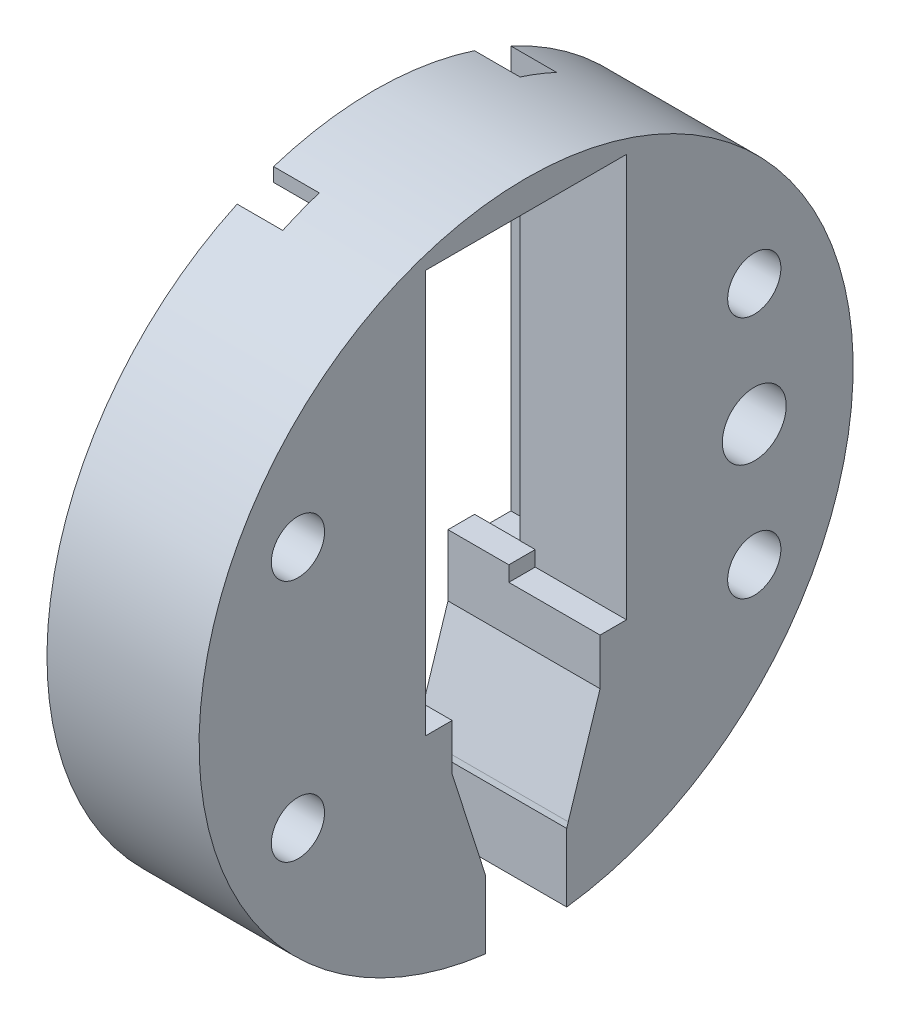
ISO-10303-21;
HEADER;
FILE_DESCRIPTION(('STEP AP214'),'2;1');
FILE_NAME('part.step','',(''),(''),'','','');
FILE_SCHEMA(('AUTOMOTIVE_DESIGN { 1 0 10303 214 1 1 1 1 }'));
ENDSEC;
DATA;
#1=APPLICATION_CONTEXT('core data for automotive mechanical design processes');
#2=APPLICATION_PROTOCOL_DEFINITION('international standard','automotive_design',2000,#1);
#3=PRODUCT_CONTEXT('',#1,'mechanical');
#4=PRODUCT('Part','Part','',(#3));
#5=PRODUCT_RELATED_PRODUCT_CATEGORY('part','',(#4));
#6=PRODUCT_DEFINITION_FORMATION('','',#4);
#7=PRODUCT_DEFINITION_CONTEXT('part definition',#1,'design');
#8=PRODUCT_DEFINITION('design','',#6,#7);
#9=PRODUCT_DEFINITION_SHAPE('','',#8);
#10=(LENGTH_UNIT() NAMED_UNIT(*) SI_UNIT(.MILLI.,.METRE.));
#11=(NAMED_UNIT(*) PLANE_ANGLE_UNIT() SI_UNIT($,.RADIAN.));
#12=(NAMED_UNIT(*) SI_UNIT($,.STERADIAN.) SOLID_ANGLE_UNIT());
#13=UNCERTAINTY_MEASURE_WITH_UNIT(LENGTH_MEASURE(1.E-05),#10,'distance_accuracy_value','');
#14=(GEOMETRIC_REPRESENTATION_CONTEXT(3) GLOBAL_UNCERTAINTY_ASSIGNED_CONTEXT((#13)) GLOBAL_UNIT_ASSIGNED_CONTEXT((#10,
#11,#12)) REPRESENTATION_CONTEXT('',''));
#15=CARTESIAN_POINT('',(0.,0.,0.));
#16=DIRECTION('',(0.,0.,1.));
#17=DIRECTION('',(1.,0.,0.));
#18=AXIS2_PLACEMENT_3D('',#15,#16,#17);
#19=CARTESIAN_POINT('',(56.710747831414,19.5568517413347,6.6));
#20=DIRECTION('',(0.,0.,-1.));
#21=DIRECTION('',(0.,1.,0.));
#22=AXIS2_PLACEMENT_3D('',#19,#20,#21);
#23=PLANE('',#22);
#24=DIRECTION('',(0.,1.,0.));
#25=VECTOR('',#24,1.);
#26=CARTESIAN_POINT('',(3.,19.5568517413347,6.6));
#27=LINE('',#26,#25);
#28=CARTESIAN_POINT('',(3.,-5.94314825866529,6.6));
#29=VERTEX_POINT('',#28);
#30=CARTESIAN_POINT('',(3.,19.5568517413347,6.6));
#31=VERTEX_POINT('',#30);
#32=EDGE_CURVE('E255',#29,#31,#27,.T.);
#33=ORIENTED_EDGE('',*,*,#32,.T.);
#34=DIRECTION('',(-1.,0.,0.));
#35=VECTOR('',#34,1.);
#36=CARTESIAN_POINT('',(56.710747831414,19.5568517413347,6.6));
#37=LINE('',#36,#35);
#38=CARTESIAN_POINT('',(10.,19.5568517413347,6.6));
#39=VERTEX_POINT('',#38);
#40=EDGE_CURVE('E304',#39,#31,#37,.T.);
#41=ORIENTED_EDGE('',*,*,#40,.F.);
#42=DIRECTION('',(0.,-1.,0.));
#43=VECTOR('',#42,1.);
#44=CARTESIAN_POINT('',(10.,19.5568517413347,6.6));
#45=LINE('',#44,#43);
#46=CARTESIAN_POINT('',(10.,-6.94314825866529,6.6));
#47=VERTEX_POINT('',#46);
#48=EDGE_CURVE('E328',#39,#47,#45,.T.);
#49=ORIENTED_EDGE('',*,*,#48,.T.);
#50=DIRECTION('',(-1.,0.,0.));
#51=VECTOR('',#50,1.);
#52=CARTESIAN_POINT('',(56.710747831414,-6.94314825866529,6.6));
#53=LINE('',#52,#51);
#54=CARTESIAN_POINT('',(6.5,-6.94314825866529,6.6));
#55=VERTEX_POINT('',#54);
#56=EDGE_CURVE('E299',#47,#55,#53,.T.);
#57=ORIENTED_EDGE('',*,*,#56,.T.);
#58=DIRECTION('',(0.,-1.,0.));
#59=VECTOR('',#58,1.);
#60=CARTESIAN_POINT('',(6.5,-5.94314825866529,6.6));
#61=LINE('',#60,#59);
#62=CARTESIAN_POINT('',(6.5,-5.94314825866529,6.6));
#63=VERTEX_POINT('',#62);
#64=EDGE_CURVE('E395',#63,#55,#61,.T.);
#65=ORIENTED_EDGE('',*,*,#64,.F.);
#66=DIRECTION('',(1.,0.,0.));
#67=VECTOR('',#66,1.);
#68=CARTESIAN_POINT('',(0.,-5.94314825866529,6.6));
#69=LINE('',#68,#67);
#70=EDGE_CURVE('E414',#29,#63,#69,.T.);
#71=ORIENTED_EDGE('',*,*,#70,.F.);
#72=EDGE_LOOP('',(#33,#41,#49,#57,#65,#71));
#73=FACE_BOUND('',#72,.T.);
#74=ADVANCED_FACE('F33',(#73),#23,.T.);
#75=CARTESIAN_POINT('',(56.710747831414,19.5568517413347,-6.6));
#76=DIRECTION('',(0.,0.,-1.));
#77=DIRECTION('',(0.,1.,0.));
#78=AXIS2_PLACEMENT_3D('',#75,#76,#77);
#79=PLANE('',#78);
#80=DIRECTION('',(-1.,0.,0.));
#81=VECTOR('',#80,1.);
#82=CARTESIAN_POINT('',(56.710747831414,19.5568517413347,-6.6));
#83=LINE('',#82,#81);
#84=CARTESIAN_POINT('',(10.,19.5568517413347,-6.6));
#85=VERTEX_POINT('',#84);
#86=CARTESIAN_POINT('',(3.,19.5568517413347,-6.6));
#87=VERTEX_POINT('',#86);
#88=EDGE_CURVE('E265',#85,#87,#83,.T.);
#89=ORIENTED_EDGE('',*,*,#88,.T.);
#90=DIRECTION('',(0.,1.,0.));
#91=VECTOR('',#90,1.);
#92=CARTESIAN_POINT('',(3.,19.5568517413347,-6.6));
#93=LINE('',#92,#91);
#94=CARTESIAN_POINT('',(3.,-5.9431482586653,-6.60000000000001));
#95=VERTEX_POINT('',#94);
#96=EDGE_CURVE('E330',#95,#87,#93,.T.);
#97=ORIENTED_EDGE('',*,*,#96,.F.);
#98=DIRECTION('',(-1.,0.,0.));
#99=VECTOR('',#98,1.);
#100=CARTESIAN_POINT('',(56.710747831414,-5.9431482586653,-6.60000000000001));
#101=LINE('',#100,#99);
#102=CARTESIAN_POINT('',(4.,-5.9431482586653,-6.60000000000001));
#103=VERTEX_POINT('',#102);
#104=EDGE_CURVE('E371',#103,#95,#101,.T.);
#105=ORIENTED_EDGE('',*,*,#104,.F.);
#106=DIRECTION('',(0.,1.,0.));
#107=VECTOR('',#106,1.);
#108=CARTESIAN_POINT('',(4.,19.5568517413347,-6.6));
#109=LINE('',#108,#107);
#110=CARTESIAN_POINT('',(4.,-6.9431482586653,-6.60000000000001));
#111=VERTEX_POINT('',#110);
#112=EDGE_CURVE('E234',#111,#103,#109,.T.);
#113=ORIENTED_EDGE('',*,*,#112,.F.);
#114=DIRECTION('',(-1.,0.,0.));
#115=VECTOR('',#114,1.);
#116=CARTESIAN_POINT('',(56.710747831414,-6.94314825866529,-6.60000000000001));
#117=LINE('',#116,#115);
#118=CARTESIAN_POINT('',(10.,-6.94314825866529,-6.60000000000001));
#119=VERTEX_POINT('',#118);
#120=EDGE_CURVE('E271',#119,#111,#117,.T.);
#121=ORIENTED_EDGE('',*,*,#120,.F.);
#122=DIRECTION('',(0.,-1.,0.));
#123=VECTOR('',#122,1.);
#124=CARTESIAN_POINT('',(10.,19.5568517413347,-6.6));
#125=LINE('',#124,#123);
#126=EDGE_CURVE('E275',#85,#119,#125,.T.);
#127=ORIENTED_EDGE('',*,*,#126,.F.);
#128=EDGE_LOOP('',(#89,#97,#105,#113,#121,#127));
#129=FACE_BOUND('',#128,.T.);
#130=ADVANCED_FACE('F487',(#129),#79,.F.);
#131=CARTESIAN_POINT('',(0.,0.,0.));
#132=DIRECTION('',(1.,0.,0.));
#133=DIRECTION('',(0.,0.,-1.));
#134=AXIS2_PLACEMENT_3D('',#131,#132,#133);
#135=PLANE('',#134);
#136=CARTESIAN_POINT('',(0.,-8.,-15.));
#137=DIRECTION('',(-1.,0.,0.));
#138=DIRECTION('',(0.,0.,-1.));
#139=AXIS2_PLACEMENT_3D('',#136,#137,#138);
#140=CIRCLE('',#139,1.75);
#141=CARTESIAN_POINT('',(0.,-8.,-16.75));
#142=VERTEX_POINT('',#141);
#143=EDGE_CURVE('E449',#142,#142,#140,.T.);
#144=ORIENTED_EDGE('',*,*,#143,.F.);
#145=EDGE_LOOP('',(#144));
#146=FACE_BOUND('',#145,.T.);
#147=CARTESIAN_POINT('',(0.,0.,-15.));
#148=DIRECTION('',(-1.,0.,0.));
#149=DIRECTION('',(0.,0.,1.));
#150=AXIS2_PLACEMENT_3D('',#147,#148,#149);
#151=CIRCLE('',#150,2.1);
#152=CARTESIAN_POINT('',(0.,0.,-12.9));
#153=VERTEX_POINT('',#152);
#154=EDGE_CURVE('E467',#153,#153,#151,.T.);
#155=ORIENTED_EDGE('',*,*,#154,.F.);
#156=EDGE_LOOP('',(#155));
#157=FACE_BOUND('',#156,.T.);
#158=CARTESIAN_POINT('',(0.,8.,-15.));
#159=DIRECTION('',(-1.,0.,0.));
#160=DIRECTION('',(0.,0.,1.));
#161=AXIS2_PLACEMENT_3D('',#158,#159,#160);
#162=CIRCLE('',#161,1.75);
#163=CARTESIAN_POINT('',(0.,8.,-13.25));
#164=VERTEX_POINT('',#163);
#165=EDGE_CURVE('E443',#164,#164,#162,.T.);
#166=ORIENTED_EDGE('',*,*,#165,.F.);
#167=EDGE_LOOP('',(#166));
#168=FACE_BOUND('',#167,.T.);
#169=DIRECTION('',(0.,-1.,0.));
#170=VECTOR('',#169,1.);
#171=CARTESIAN_POINT('',(0.,-6.9431482586653,-9.));
#172=LINE('',#171,#170);
#173=CARTESIAN_POINT('',(0.,19.5256241897666,-9.00000000000001));
#174=VERTEX_POINT('',#173);
#175=CARTESIAN_POINT('',(0.,-6.9431482586653,-9.));
#176=VERTEX_POINT('',#175);
#177=EDGE_CURVE('E222',#174,#176,#172,.T.);
#178=ORIENTED_EDGE('',*,*,#177,.F.);
#179=CARTESIAN_POINT('',(0.,0.,0.));
#180=DIRECTION('',(1.,0.,0.));
#181=DIRECTION('',(0.,0.,-1.));
#182=AXIS2_PLACEMENT_3D('',#179,#180,#181);
#183=CIRCLE('',#182,21.5);
#184=CARTESIAN_POINT('',(0.,-21.3335148584078,-2.67042015160433));
#185=VERTEX_POINT('',#184);
#186=EDGE_CURVE('E227',#185,#174,#183,.T.);
#187=ORIENTED_EDGE('',*,*,#186,.F.);
#188=DIRECTION('',(0.,-1.,0.));
#189=VECTOR('',#188,1.);
#190=CARTESIAN_POINT('',(0.,-16.8581606699215,-2.67042015160433));
#191=LINE('',#190,#189);
#192=CARTESIAN_POINT('',(0.,-16.8581606699215,-2.67042015160433));
#193=VERTEX_POINT('',#192);
#194=EDGE_CURVE('E343',#193,#185,#191,.T.);
#195=ORIENTED_EDGE('',*,*,#194,.F.);
#196=DIRECTION('',(0.,0.956480231946945,-0.291797131402484));
#197=VECTOR('',#196,1.);
#198=CARTESIAN_POINT('',(0.,-16.8581606699215,-2.67042015160433));
#199=LINE('',#198,#197);
#200=CARTESIAN_POINT('',(0.,-16.5303712131336,-2.77042015160435));
#201=VERTEX_POINT('',#200);
#202=EDGE_CURVE('E287',#193,#201,#199,.T.);
#203=ORIENTED_EDGE('',*,*,#202,.T.);
#204=DIRECTION('',(0.,-0.95232868819424,0.305073875712488));
#205=VECTOR('',#204,1.);
#206=CARTESIAN_POINT('',(0.,-10.,-4.86239289224447));
#207=LINE('',#206,#205);
#208=CARTESIAN_POINT('',(0.,-10.,-4.86239289224447));
#209=VERTEX_POINT('',#208);
#210=EDGE_CURVE('E339',#209,#201,#207,.T.);
#211=ORIENTED_EDGE('',*,*,#210,.F.);
#212=DIRECTION('',(0.,1.,0.));
#213=VECTOR('',#212,1.);
#214=CARTESIAN_POINT('',(0.,-10.,-4.86239289224447));
#215=LINE('',#214,#213);
#216=CARTESIAN_POINT('',(0.,-5.9431482586653,-4.86239289224447));
#217=VERTEX_POINT('',#216);
#218=EDGE_CURVE('E281',#209,#217,#215,.T.);
#219=ORIENTED_EDGE('',*,*,#218,.T.);
#220=DIRECTION('',(0.,0.,1.));
#221=VECTOR('',#220,1.);
#222=CARTESIAN_POINT('',(0.,-5.9431482586653,-4.86239289224447));
#223=LINE('',#222,#221);
#224=CARTESIAN_POINT('',(0.,-5.9431482586653,-6.61239289224447));
#225=VERTEX_POINT('',#224);
#226=EDGE_CURVE('E377',#225,#217,#223,.T.);
#227=ORIENTED_EDGE('',*,*,#226,.F.);
#228=DIRECTION('',(0.,-1.,0.));
#229=VECTOR('',#228,1.);
#230=CARTESIAN_POINT('',(0.,-5.9431482586653,-6.61239289224447));
#231=LINE('',#230,#229);
#232=CARTESIAN_POINT('',(0.,-6.9431482586653,-6.61239289224447));
#233=VERTEX_POINT('',#232);
#234=EDGE_CURVE('E375',#225,#233,#231,.T.);
#235=ORIENTED_EDGE('',*,*,#234,.T.);
#236=DIRECTION('',(0.,0.,1.));
#237=VECTOR('',#236,1.);
#238=CARTESIAN_POINT('',(0.,-6.94314825866529,-6.60000000000001));
#239=LINE('',#238,#237);
#240=EDGE_CURVE('E230',#176,#233,#239,.T.);
#241=ORIENTED_EDGE('',*,*,#240,.F.);
#242=EDGE_LOOP('',(#178,#187,#195,#203,#211,#219,#227,#235,#241));
#243=FACE_BOUND('',#242,.T.);
#244=ADVANCED_FACE('F224',(#146,#157,#168,#243),#135,.F.);
#245=CARTESIAN_POINT('',(0.,-7.99999999999999,15.));
#246=DIRECTION('',(-1.,0.,0.));
#247=DIRECTION('',(0.,0.,1.));
#248=AXIS2_PLACEMENT_3D('',#245,#246,#247);
#249=CIRCLE('',#248,1.75);
#250=CARTESIAN_POINT('',(0.,-7.99999999999999,16.75));
#251=VERTEX_POINT('',#250);
#252=EDGE_CURVE('E455',#251,#251,#249,.T.);
#253=ORIENTED_EDGE('',*,*,#252,.F.);
#254=EDGE_LOOP('',(#253));
#255=FACE_BOUND('',#254,.T.);
#256=CARTESIAN_POINT('',(0.,8.,15.));
#257=DIRECTION('',(-1.,0.,0.));
#258=DIRECTION('',(0.,0.,-1.));
#259=AXIS2_PLACEMENT_3D('',#256,#257,#258);
#260=CIRCLE('',#259,1.75);
#261=CARTESIAN_POINT('',(0.,8.,13.25));
#262=VERTEX_POINT('',#261);
#263=EDGE_CURVE('E461',#262,#262,#260,.T.);
#264=ORIENTED_EDGE('',*,*,#263,.F.);
#265=EDGE_LOOP('',(#264));
#266=FACE_BOUND('',#265,.T.);
#267=CARTESIAN_POINT('',(0.,19.5256241897666,9.00000000000001));
#268=VERTEX_POINT('',#267);
#269=CARTESIAN_POINT('',(0.,-21.3335148584078,2.67042015160433));
#270=VERTEX_POINT('',#269);
#271=EDGE_CURVE('E253',#268,#270,#183,.T.);
#272=ORIENTED_EDGE('',*,*,#271,.F.);
#273=DIRECTION('',(0.,1.,0.));
#274=VECTOR('',#273,1.);
#275=CARTESIAN_POINT('',(0.,17.1748906632346,9.));
#276=LINE('',#275,#274);
#277=CARTESIAN_POINT('',(0.,-6.9431482586653,9.00000000000001));
#278=VERTEX_POINT('',#277);
#279=EDGE_CURVE('E233',#278,#268,#276,.T.);
#280=ORIENTED_EDGE('',*,*,#279,.F.);
#281=DIRECTION('',(0.,0.,-1.));
#282=VECTOR('',#281,1.);
#283=CARTESIAN_POINT('',(0.,-6.94314825866529,6.6));
#284=LINE('',#283,#282);
#285=CARTESIAN_POINT('',(0.,-6.94314825866529,6.6));
#286=VERTEX_POINT('',#285);
#287=EDGE_CURVE('E303',#278,#286,#284,.T.);
#288=ORIENTED_EDGE('',*,*,#287,.T.);
#289=DIRECTION('',(0.,-1.,0.));
#290=VECTOR('',#289,1.);
#291=CARTESIAN_POINT('',(0.,-5.94314825866529,6.6));
#292=LINE('',#291,#290);
#293=CARTESIAN_POINT('',(0.,-5.94314825866529,6.6));
#294=VERTEX_POINT('',#293);
#295=EDGE_CURVE('E383',#294,#286,#292,.T.);
#296=ORIENTED_EDGE('',*,*,#295,.F.);
#297=DIRECTION('',(0.,0.,1.));
#298=VECTOR('',#297,1.);
#299=CARTESIAN_POINT('',(0.,-5.94314825866529,4.86239289224446));
#300=LINE('',#299,#298);
#301=CARTESIAN_POINT('',(0.,-5.94314825866529,4.86239289224446));
#302=VERTEX_POINT('',#301);
#303=EDGE_CURVE('E404',#302,#294,#300,.T.);
#304=ORIENTED_EDGE('',*,*,#303,.F.);
#305=DIRECTION('',(0.,1.,0.));
#306=VECTOR('',#305,1.);
#307=CARTESIAN_POINT('',(0.,-10.,4.86239289224446));
#308=LINE('',#307,#306);
#309=CARTESIAN_POINT('',(0.,-10.,4.86239289224446));
#310=VERTEX_POINT('',#309);
#311=EDGE_CURVE('E335',#310,#302,#308,.T.);
#312=ORIENTED_EDGE('',*,*,#311,.F.);
#313=DIRECTION('',(0.,-0.952328688194239,-0.305073875712489));
#314=VECTOR('',#313,1.);
#315=CARTESIAN_POINT('',(0.,-10.,4.86239289224446));
#316=LINE('',#315,#314);
#317=CARTESIAN_POINT('',(0.,-16.5303712131336,2.77042015160432));
#318=VERTEX_POINT('',#317);
#319=EDGE_CURVE('E297',#310,#318,#316,.T.);
#320=ORIENTED_EDGE('',*,*,#319,.T.);
#321=DIRECTION('',(0.,0.956480231946964,0.291797131402422));
#322=VECTOR('',#321,1.);
#323=CARTESIAN_POINT('',(0.,-16.8581606699215,2.67042015160433));
#324=LINE('',#323,#322);
#325=CARTESIAN_POINT('',(0.,-16.8581606699215,2.67042015160433));
#326=VERTEX_POINT('',#325);
#327=EDGE_CURVE('E347',#326,#318,#324,.T.);
#328=ORIENTED_EDGE('',*,*,#327,.F.);
#329=DIRECTION('',(0.,-1.,0.));
#330=VECTOR('',#329,1.);
#331=CARTESIAN_POINT('',(0.,-16.8581606699215,2.67042015160433));
#332=LINE('',#331,#330);
#333=EDGE_CURVE('E290',#326,#270,#332,.T.);
#334=ORIENTED_EDGE('',*,*,#333,.T.);
#335=EDGE_LOOP('',(#272,#280,#288,#296,#304,#312,#320,#328,#334));
#336=FACE_BOUND('',#335,.T.);
#337=ADVANCED_FACE('F486',(#255,#266,#336),#135,.F.);
#338=CARTESIAN_POINT('',(56.710747831414,-6.94314825866529,6.6));
#339=DIRECTION('',(0.,1.,0.));
#340=DIRECTION('',(0.,0.,1.));
#341=AXIS2_PLACEMENT_3D('',#338,#339,#340);
#342=PLANE('',#341);
#343=DIRECTION('',(0.,0.,1.));
#344=VECTOR('',#343,1.);
#345=CARTESIAN_POINT('',(3.,-6.9431482586653,9.00000000000001));
#346=LINE('',#345,#344);
#347=CARTESIAN_POINT('',(3.,-6.9431482586653,6.6));
#348=VERTEX_POINT('',#347);
#349=CARTESIAN_POINT('',(3.,-6.9431482586653,9.00000000000001));
#350=VERTEX_POINT('',#349);
#351=EDGE_CURVE('E368',#348,#350,#346,.T.);
#352=ORIENTED_EDGE('',*,*,#351,.F.);
#353=DIRECTION('',(1.,0.,0.));
#354=VECTOR('',#353,1.);
#355=CARTESIAN_POINT('',(0.,-6.94314825866529,6.6));
#356=LINE('',#355,#354);
#357=EDGE_CURVE('E48',#286,#348,#356,.T.);
#358=ORIENTED_EDGE('',*,*,#357,.F.);
#359=ORIENTED_EDGE('',*,*,#287,.F.);
#360=DIRECTION('',(-1.,0.,0.));
#361=VECTOR('',#360,1.);
#362=CARTESIAN_POINT('',(3.,-6.9431482586653,9.00000000000001));
#363=LINE('',#362,#361);
#364=EDGE_CURVE('E357',#350,#278,#363,.T.);
#365=ORIENTED_EDGE('',*,*,#364,.F.);
#366=EDGE_LOOP('',(#352,#358,#359,#365));
#367=FACE_BOUND('',#366,.T.);
#368=ADVANCED_FACE('F517',(#367),#342,.T.);
#369=DIRECTION('',(-1.,0.,0.));
#370=VECTOR('',#369,1.);
#371=CARTESIAN_POINT('',(56.710747831414,-6.94314825866529,4.86239289224446));
#372=LINE('',#371,#370);
#373=CARTESIAN_POINT('',(10.,-6.94314825866529,4.86239289224446));
#374=VERTEX_POINT('',#373);
#375=CARTESIAN_POINT('',(6.5,-6.94314825866529,4.86239289224446));
#376=VERTEX_POINT('',#375);
#377=EDGE_CURVE('E56',#374,#376,#372,.T.);
#378=ORIENTED_EDGE('',*,*,#377,.T.);
#379=DIRECTION('',(0.,0.,-1.));
#380=VECTOR('',#379,1.);
#381=CARTESIAN_POINT('',(6.5,-6.94314825866529,4.86239289224446));
#382=LINE('',#381,#380);
#383=EDGE_CURVE('E402',#55,#376,#382,.T.);
#384=ORIENTED_EDGE('',*,*,#383,.F.);
#385=ORIENTED_EDGE('',*,*,#56,.F.);
#386=DIRECTION('',(0.,0.,-1.));
#387=VECTOR('',#386,1.);
#388=CARTESIAN_POINT('',(10.,-6.94314825866529,6.6));
#389=LINE('',#388,#387);
#390=EDGE_CURVE('E324',#47,#374,#389,.T.);
#391=ORIENTED_EDGE('',*,*,#390,.T.);
#392=EDGE_LOOP('',(#378,#384,#385,#391));
#393=FACE_BOUND('',#392,.T.);
#394=ADVANCED_FACE('F520',(#393),#342,.T.);
#395=CARTESIAN_POINT('',(56.710747831414,-6.94314825866529,-6.60000000000001));
#396=DIRECTION('',(0.,-1.,0.));
#397=DIRECTION('',(0.,0.,-1.));
#398=AXIS2_PLACEMENT_3D('',#395,#396,#397);
#399=PLANE('',#398);
#400=DIRECTION('',(0.,0.,-1.));
#401=VECTOR('',#400,1.);
#402=CARTESIAN_POINT('',(4.,-6.9431482586653,-6.61239289224447));
#403=LINE('',#402,#401);
#404=CARTESIAN_POINT('',(4.,-6.9431482586653,-4.86239289224447));
#405=VERTEX_POINT('',#404);
#406=EDGE_CURVE('E381',#405,#111,#403,.T.);
#407=ORIENTED_EDGE('',*,*,#406,.F.);
#408=DIRECTION('',(-1.,0.,0.));
#409=VECTOR('',#408,1.);
#410=CARTESIAN_POINT('',(56.710747831414,-6.94314825866529,-4.86239289224447));
#411=LINE('',#410,#409);
#412=CARTESIAN_POINT('',(10.,-6.94314825866529,-4.86239289224447));
#413=VERTEX_POINT('',#412);
#414=EDGE_CURVE('E276',#413,#405,#411,.T.);
#415=ORIENTED_EDGE('',*,*,#414,.F.);
#416=DIRECTION('',(0.,0.,1.));
#417=VECTOR('',#416,1.);
#418=CARTESIAN_POINT('',(10.,-6.94314825866529,-6.60000000000001));
#419=LINE('',#418,#417);
#420=EDGE_CURVE('E274',#119,#413,#419,.T.);
#421=ORIENTED_EDGE('',*,*,#420,.F.);
#422=ORIENTED_EDGE('',*,*,#120,.T.);
#423=EDGE_LOOP('',(#407,#415,#421,#422));
#424=FACE_BOUND('',#423,.T.);
#425=ADVANCED_FACE('F553',(#424),#399,.F.);
#426=DIRECTION('',(-1.,0.,0.));
#427=VECTOR('',#426,1.);
#428=CARTESIAN_POINT('',(0.,-6.9431482586653,-6.61239289224447));
#429=LINE('',#428,#427);
#430=CARTESIAN_POINT('',(3.,-6.9431482586653,-6.61239289224447));
#431=VERTEX_POINT('',#430);
#432=EDGE_CURVE('E378',#431,#233,#429,.T.);
#433=ORIENTED_EDGE('',*,*,#432,.F.);
#434=CARTESIAN_POINT('',(3.,-6.9431482586653,-9.));
#435=VERTEX_POINT('',#434);
#436=EDGE_CURVE('E365',#435,#431,#346,.T.);
#437=ORIENTED_EDGE('',*,*,#436,.F.);
#438=DIRECTION('',(-1.,0.,0.));
#439=VECTOR('',#438,1.);
#440=CARTESIAN_POINT('',(3.,-6.9431482586653,-9.));
#441=LINE('',#440,#439);
#442=EDGE_CURVE('E358',#435,#176,#441,.T.);
#443=ORIENTED_EDGE('',*,*,#442,.T.);
#444=ORIENTED_EDGE('',*,*,#240,.T.);
#445=EDGE_LOOP('',(#433,#437,#443,#444));
#446=FACE_BOUND('',#445,.T.);
#447=ADVANCED_FACE('F555',(#446),#399,.F.);
#448=CARTESIAN_POINT('',(3.,0.,0.));
#449=DIRECTION('',(-1.,0.,0.));
#450=DIRECTION('',(0.,0.,1.));
#451=AXIS2_PLACEMENT_3D('',#448,#449,#450);
#452=PLANE('',#451);
#453=ORIENTED_EDGE('',*,*,#436,.T.);
#454=DIRECTION('',(0.,1.,0.));
#455=VECTOR('',#454,1.);
#456=CARTESIAN_POINT('',(3.,0.,-6.61239289224447));
#457=LINE('',#456,#455);
#458=CARTESIAN_POINT('',(3.,-5.9431482586653,-6.61239289224447));
#459=VERTEX_POINT('',#458);
#460=EDGE_CURVE('E11',#431,#459,#457,.T.);
#461=ORIENTED_EDGE('',*,*,#460,.T.);
#462=DIRECTION('',(0.,0.,1.));
#463=VECTOR('',#462,1.);
#464=CARTESIAN_POINT('',(3.,-5.9431482586653,0.));
#465=LINE('',#464,#463);
#466=EDGE_CURVE('E41',#459,#95,#465,.T.);
#467=ORIENTED_EDGE('',*,*,#466,.T.);
#468=ORIENTED_EDGE('',*,*,#96,.T.);
#469=DIRECTION('',(0.,1.,0.));
#470=VECTOR('',#469,1.);
#471=CARTESIAN_POINT('',(3.,0.,-6.6));
#472=LINE('',#471,#470);
#473=CARTESIAN_POINT('',(3.,20.4619158438305,-6.6));
#474=VERTEX_POINT('',#473);
#475=EDGE_CURVE('E432',#87,#474,#472,.T.);
#476=ORIENTED_EDGE('',*,*,#475,.T.);
#477=CARTESIAN_POINT('',(3.,0.,0.));
#478=DIRECTION('',(-1.,0.,0.));
#479=DIRECTION('',(0.,0.,1.));
#480=AXIS2_PLACEMENT_3D('',#477,#478,#479);
#481=CIRCLE('',#480,21.5);
#482=CARTESIAN_POINT('',(3.,19.5256241897666,-9.00000000000001));
#483=VERTEX_POINT('',#482);
#484=EDGE_CURVE('E430',#474,#483,#481,.T.);
#485=ORIENTED_EDGE('',*,*,#484,.T.);
#486=DIRECTION('',(0.,-1.,0.));
#487=VECTOR('',#486,1.);
#488=CARTESIAN_POINT('',(3.,-6.9431482586653,-9.));
#489=LINE('',#488,#487);
#490=EDGE_CURVE('E240',#483,#435,#489,.T.);
#491=ORIENTED_EDGE('',*,*,#490,.T.);
#492=EDGE_LOOP('',(#453,#461,#467,#468,#476,#485,#491));
#493=FACE_BOUND('',#492,.T.);
#494=ADVANCED_FACE('F600',(#493),#452,.T.);
#495=CARTESIAN_POINT('',(10.,0.,0.));
#496=DIRECTION('',(-1.,0.,0.));
#497=DIRECTION('',(0.,0.,1.));
#498=AXIS2_PLACEMENT_3D('',#495,#496,#497);
#499=CYLINDRICAL_SURFACE('',#498,21.5);
#500=ORIENTED_EDGE('',*,*,#186,.T.);
#501=DIRECTION('',(-1.,0.,0.));
#502=VECTOR('',#501,1.);
#503=CARTESIAN_POINT('',(10.,19.5256241897666,-9.00000000000001));
#504=LINE('',#503,#502);
#505=EDGE_CURVE('E237',#174,#483,#504,.F.);
#506=ORIENTED_EDGE('',*,*,#505,.T.);
#507=ORIENTED_EDGE('',*,*,#484,.F.);
#508=DIRECTION('',(-1.,0.,0.));
#509=VECTOR('',#508,1.);
#510=CARTESIAN_POINT('',(10.,20.4619158438305,-6.6));
#511=LINE('',#510,#509);
#512=CARTESIAN_POINT('',(0.,20.4619158438305,-6.6));
#513=VERTEX_POINT('',#512);
#514=EDGE_CURVE('E245',#474,#513,#511,.T.);
#515=ORIENTED_EDGE('',*,*,#514,.T.);
#516=CARTESIAN_POINT('',(0.,20.4619158438305,6.6));
#517=VERTEX_POINT('',#516);
#518=EDGE_CURVE('E251',#513,#517,#183,.T.);
#519=ORIENTED_EDGE('',*,*,#518,.T.);
#520=DIRECTION('',(-1.,0.,0.));
#521=VECTOR('',#520,1.);
#522=CARTESIAN_POINT('',(10.,20.4619158438305,6.6));
#523=LINE('',#522,#521);
#524=CARTESIAN_POINT('',(3.,20.4619158438305,6.6));
#525=VERTEX_POINT('',#524);
#526=EDGE_CURVE('E418',#517,#525,#523,.F.);
#527=ORIENTED_EDGE('',*,*,#526,.T.);
#528=CARTESIAN_POINT('',(3.,0.,0.));
#529=DIRECTION('',(-1.,0.,0.));
#530=DIRECTION('',(0.,0.,1.));
#531=AXIS2_PLACEMENT_3D('',#528,#529,#530);
#532=CIRCLE('',#531,21.5);
#533=CARTESIAN_POINT('',(3.,19.5256241897666,9.00000000000001));
#534=VERTEX_POINT('',#533);
#535=EDGE_CURVE('E244',#534,#525,#532,.T.);
#536=ORIENTED_EDGE('',*,*,#535,.F.);
#537=DIRECTION('',(-1.,0.,0.));
#538=VECTOR('',#537,1.);
#539=CARTESIAN_POINT('',(10.,19.5256241897666,9.00000000000001));
#540=LINE('',#539,#538);
#541=EDGE_CURVE('E406',#534,#268,#540,.T.);
#542=ORIENTED_EDGE('',*,*,#541,.T.);
#543=ORIENTED_EDGE('',*,*,#271,.T.);
#544=DIRECTION('',(-1.,0.,0.));
#545=VECTOR('',#544,1.);
#546=CARTESIAN_POINT('',(10.,-21.3335148584078,2.67042015160433));
#547=LINE('',#546,#545);
#548=CARTESIAN_POINT('',(10.,-21.3335148584078,2.67042015160433));
#549=VERTEX_POINT('',#548);
#550=EDGE_CURVE('E263',#549,#270,#547,.T.);
#551=ORIENTED_EDGE('',*,*,#550,.F.);
#552=CARTESIAN_POINT('',(10.,0.,0.));
#553=DIRECTION('',(1.,0.,0.));
#554=DIRECTION('',(0.,0.,-1.));
#555=AXIS2_PLACEMENT_3D('',#552,#553,#554);
#556=CIRCLE('',#555,21.5);
#557=CARTESIAN_POINT('',(10.,-21.3335148584078,-2.67042015160433));
#558=VERTEX_POINT('',#557);
#559=EDGE_CURVE('E250',#558,#549,#556,.T.);
#560=ORIENTED_EDGE('',*,*,#559,.F.);
#561=DIRECTION('',(-1.,0.,0.));
#562=VECTOR('',#561,1.);
#563=CARTESIAN_POINT('',(10.,-21.3335148584078,-2.67042015160433));
#564=LINE('',#563,#562);
#565=EDGE_CURVE('E249',#558,#185,#564,.T.);
#566=ORIENTED_EDGE('',*,*,#565,.T.);
#567=EDGE_LOOP('',(#500,#506,#507,#515,#519,#527,#536,#542,#543,#551,#560,#566));
#568=FACE_BOUND('',#567,.T.);
#569=ADVANCED_FACE('F35',(#568),#499,.T.);
#570=CARTESIAN_POINT('',(10.,0.,0.));
#571=DIRECTION('',(1.,0.,0.));
#572=DIRECTION('',(0.,0.,-1.));
#573=AXIS2_PLACEMENT_3D('',#570,#571,#572);
#574=PLANE('',#573);
#575=CARTESIAN_POINT('',(10.,-8.,-15.));
#576=DIRECTION('',(-1.,0.,0.));
#577=DIRECTION('',(0.,0.,-1.));
#578=AXIS2_PLACEMENT_3D('',#575,#576,#577);
#579=CIRCLE('',#578,1.75);
#580=CARTESIAN_POINT('',(10.,-8.,-16.75));
#581=VERTEX_POINT('',#580);
#582=EDGE_CURVE('E452',#581,#581,#579,.T.);
#583=ORIENTED_EDGE('',*,*,#582,.T.);
#584=EDGE_LOOP('',(#583));
#585=FACE_BOUND('',#584,.T.);
#586=CARTESIAN_POINT('',(10.,-7.99999999999999,15.));
#587=DIRECTION('',(-1.,0.,0.));
#588=DIRECTION('',(0.,0.,1.));
#589=AXIS2_PLACEMENT_3D('',#586,#587,#588);
#590=CIRCLE('',#589,1.75);
#591=CARTESIAN_POINT('',(10.,-7.99999999999999,16.75));
#592=VERTEX_POINT('',#591);
#593=EDGE_CURVE('E458',#592,#592,#590,.T.);
#594=ORIENTED_EDGE('',*,*,#593,.T.);
#595=EDGE_LOOP('',(#594));
#596=FACE_BOUND('',#595,.T.);
#597=CARTESIAN_POINT('',(10.,8.,15.));
#598=DIRECTION('',(-1.,0.,0.));
#599=DIRECTION('',(0.,0.,-1.));
#600=AXIS2_PLACEMENT_3D('',#597,#598,#599);
#601=CIRCLE('',#600,1.75);
#602=CARTESIAN_POINT('',(10.,8.,13.25));
#603=VERTEX_POINT('',#602);
#604=EDGE_CURVE('E464',#603,#603,#601,.T.);
#605=ORIENTED_EDGE('',*,*,#604,.T.);
#606=EDGE_LOOP('',(#605));
#607=FACE_BOUND('',#606,.T.);
#608=CARTESIAN_POINT('',(10.,0.,-15.));
#609=DIRECTION('',(-1.,0.,0.));
#610=DIRECTION('',(0.,0.,1.));
#611=AXIS2_PLACEMENT_3D('',#608,#609,#610);
#612=CIRCLE('',#611,2.1);
#613=CARTESIAN_POINT('',(10.,0.,-12.9));
#614=VERTEX_POINT('',#613);
#615=EDGE_CURVE('E446',#614,#614,#612,.T.);
#616=ORIENTED_EDGE('',*,*,#615,.T.);
#617=EDGE_LOOP('',(#616));
#618=FACE_BOUND('',#617,.T.);
#619=CARTESIAN_POINT('',(10.,8.,-15.));
#620=DIRECTION('',(-1.,0.,0.));
#621=DIRECTION('',(0.,0.,1.));
#622=AXIS2_PLACEMENT_3D('',#619,#620,#621);
#623=CIRCLE('',#622,1.75);
#624=CARTESIAN_POINT('',(10.,8.,-13.25));
#625=VERTEX_POINT('',#624);
#626=EDGE_CURVE('E436',#625,#625,#623,.T.);
#627=ORIENTED_EDGE('',*,*,#626,.T.);
#628=EDGE_LOOP('',(#627));
#629=FACE_BOUND('',#628,.T.);
#630=DIRECTION('',(0.,-1.,0.));
#631=VECTOR('',#630,1.);
#632=CARTESIAN_POINT('',(10.,-16.8581606699215,-2.67042015160433));
#633=LINE('',#632,#631);
#634=CARTESIAN_POINT('',(10.,-16.8581606699215,-2.67042015160433));
#635=VERTEX_POINT('',#634);
#636=EDGE_CURVE('E291',#635,#558,#633,.T.);
#637=ORIENTED_EDGE('',*,*,#636,.T.);
#638=ORIENTED_EDGE('',*,*,#559,.T.);
#639=DIRECTION('',(0.,-1.,0.));
#640=VECTOR('',#639,1.);
#641=CARTESIAN_POINT('',(10.,-16.8581606699215,2.67042015160433));
#642=LINE('',#641,#640);
#643=CARTESIAN_POINT('',(10.,-16.8581606699215,2.67042015160433));
#644=VERTEX_POINT('',#643);
#645=EDGE_CURVE('E316',#644,#549,#642,.T.);
#646=ORIENTED_EDGE('',*,*,#645,.F.);
#647=DIRECTION('',(0.,0.956480231946964,0.291797131402422));
#648=VECTOR('',#647,1.);
#649=CARTESIAN_POINT('',(10.,-16.8581606699215,2.67042015160433));
#650=LINE('',#649,#648);
#651=CARTESIAN_POINT('',(10.,-16.5303712131336,2.77042015160433));
#652=VERTEX_POINT('',#651);
#653=EDGE_CURVE('E295',#644,#652,#650,.T.);
#654=ORIENTED_EDGE('',*,*,#653,.T.);
#655=DIRECTION('',(0.,-0.95232868819424,-0.305073875712489));
#656=VECTOR('',#655,1.);
#657=CARTESIAN_POINT('',(10.,-10.,4.86239289224446));
#658=LINE('',#657,#656);
#659=CARTESIAN_POINT('',(10.,-10.,4.86239289224446));
#660=VERTEX_POINT('',#659);
#661=EDGE_CURVE('E320',#660,#652,#658,.T.);
#662=ORIENTED_EDGE('',*,*,#661,.F.);
#663=DIRECTION('',(0.,1.,0.));
#664=VECTOR('',#663,1.);
#665=CARTESIAN_POINT('',(10.,-10.,4.86239289224446));
#666=LINE('',#665,#664);
#667=EDGE_CURVE('E300',#660,#374,#666,.T.);
#668=ORIENTED_EDGE('',*,*,#667,.T.);
#669=ORIENTED_EDGE('',*,*,#390,.F.);
#670=ORIENTED_EDGE('',*,*,#48,.F.);
#671=DIRECTION('',(0.,0.,-1.));
#672=VECTOR('',#671,1.);
#673=CARTESIAN_POINT('',(10.,19.5568517413347,6.6));
#674=LINE('',#673,#672);
#675=EDGE_CURVE('E270',#39,#85,#674,.T.);
#676=ORIENTED_EDGE('',*,*,#675,.T.);
#677=ORIENTED_EDGE('',*,*,#126,.T.);
#678=ORIENTED_EDGE('',*,*,#420,.T.);
#679=DIRECTION('',(0.,1.,0.));
#680=VECTOR('',#679,1.);
#681=CARTESIAN_POINT('',(10.,-10.,-4.86239289224447));
#682=LINE('',#681,#680);
#683=CARTESIAN_POINT('',(10.,-10.,-4.86239289224447));
#684=VERTEX_POINT('',#683);
#685=EDGE_CURVE('E309',#684,#413,#682,.T.);
#686=ORIENTED_EDGE('',*,*,#685,.F.);
#687=DIRECTION('',(0.,-0.95232868819424,0.305073875712488));
#688=VECTOR('',#687,1.);
#689=CARTESIAN_POINT('',(10.,-10.,-4.86239289224447));
#690=LINE('',#689,#688);
#691=CARTESIAN_POINT('',(10.,-16.5303712131336,-2.77042015160435));
#692=VERTEX_POINT('',#691);
#693=EDGE_CURVE('E285',#684,#692,#690,.T.);
#694=ORIENTED_EDGE('',*,*,#693,.T.);
#695=DIRECTION('',(0.,0.956480231946945,-0.291797131402484));
#696=VECTOR('',#695,1.);
#697=CARTESIAN_POINT('',(10.,-16.8581606699215,-2.67042015160433));
#698=LINE('',#697,#696);
#699=EDGE_CURVE('E312',#635,#692,#698,.T.);
#700=ORIENTED_EDGE('',*,*,#699,.F.);
#701=EDGE_LOOP('',(#637,#638,#646,#654,#662,#668,#669,#670,#676,#677,#678,#686,#694,#700));
#702=FACE_BOUND('',#701,.T.);
#703=ADVANCED_FACE('F473',(#585,#596,#607,#618,#629,#702),#574,.T.);
#704=ORIENTED_EDGE('',*,*,#518,.F.);
#705=DIRECTION('',(0.,1.,0.));
#706=VECTOR('',#705,1.);
#707=CARTESIAN_POINT('',(0.,0.,-6.6));
#708=LINE('',#707,#706);
#709=CARTESIAN_POINT('',(0.,19.5568517413347,-6.6));
#710=VERTEX_POINT('',#709);
#711=EDGE_CURVE('E439',#710,#513,#708,.T.);
#712=ORIENTED_EDGE('',*,*,#711,.F.);
#713=DIRECTION('',(0.,0.,-1.));
#714=VECTOR('',#713,1.);
#715=CARTESIAN_POINT('',(0.,19.5568517413347,6.6));
#716=LINE('',#715,#714);
#717=CARTESIAN_POINT('',(0.,19.5568517413347,6.6));
#718=VERTEX_POINT('',#717);
#719=EDGE_CURVE('E311',#718,#710,#716,.T.);
#720=ORIENTED_EDGE('',*,*,#719,.F.);
#721=DIRECTION('',(0.,-1.,0.));
#722=VECTOR('',#721,1.);
#723=CARTESIAN_POINT('',(0.,0.,6.6));
#724=LINE('',#723,#722);
#725=EDGE_CURVE('E433',#517,#718,#724,.T.);
#726=ORIENTED_EDGE('',*,*,#725,.F.);
#727=EDGE_LOOP('',(#704,#712,#720,#726));
#728=FACE_BOUND('',#727,.T.);
#729=ADVANCED_FACE('F489',(#728),#135,.F.);
#730=CARTESIAN_POINT('',(56.710747831414,-16.8581606699215,-2.67042015160433));
#731=DIRECTION('',(0.,0.,-1.));
#732=DIRECTION('',(-1.,0.,0.));
#733=AXIS2_PLACEMENT_3D('',#730,#731,#732);
#734=PLANE('',#733);
#735=ORIENTED_EDGE('',*,*,#636,.F.);
#736=DIRECTION('',(-1.,0.,0.));
#737=VECTOR('',#736,1.);
#738=CARTESIAN_POINT('',(56.710747831414,-16.8581606699215,-2.67042015160433));
#739=LINE('',#738,#737);
#740=EDGE_CURVE('E284',#635,#193,#739,.T.);
#741=ORIENTED_EDGE('',*,*,#740,.T.);
#742=ORIENTED_EDGE('',*,*,#194,.T.);
#743=ORIENTED_EDGE('',*,*,#565,.F.);
#744=EDGE_LOOP('',(#735,#741,#742,#743));
#745=FACE_BOUND('',#744,.T.);
#746=ADVANCED_FACE('F538',(#745),#734,.F.);
#747=CARTESIAN_POINT('',(56.710747831414,-16.8581606699215,2.67042015160433));
#748=DIRECTION('',(0.,0.,-1.));
#749=DIRECTION('',(-1.,0.,0.));
#750=AXIS2_PLACEMENT_3D('',#747,#748,#749);
#751=PLANE('',#750);
#752=ORIENTED_EDGE('',*,*,#550,.T.);
#753=ORIENTED_EDGE('',*,*,#333,.F.);
#754=DIRECTION('',(-1.,0.,0.));
#755=VECTOR('',#754,1.);
#756=CARTESIAN_POINT('',(56.710747831414,-16.8581606699215,2.67042015160433));
#757=LINE('',#756,#755);
#758=EDGE_CURVE('E288',#644,#326,#757,.T.);
#759=ORIENTED_EDGE('',*,*,#758,.F.);
#760=ORIENTED_EDGE('',*,*,#645,.T.);
#761=EDGE_LOOP('',(#752,#753,#759,#760));
#762=FACE_BOUND('',#761,.T.);
#763=ADVANCED_FACE('F534',(#762),#751,.T.);
#764=CARTESIAN_POINT('',(56.710747831414,-10.,-4.86239289224447));
#765=DIRECTION('',(0.,0.,1.));
#766=DIRECTION('',(0.,-1.,0.));
#767=AXIS2_PLACEMENT_3D('',#764,#765,#766);
#768=PLANE('',#767);
#769=ORIENTED_EDGE('',*,*,#685,.T.);
#770=ORIENTED_EDGE('',*,*,#414,.T.);
#771=DIRECTION('',(0.,-1.,0.));
#772=VECTOR('',#771,1.);
#773=CARTESIAN_POINT('',(4.,-5.9431482586653,-4.86239289224447));
#774=LINE('',#773,#772);
#775=CARTESIAN_POINT('',(4.,-5.9431482586653,-4.86239289224447));
#776=VERTEX_POINT('',#775);
#777=EDGE_CURVE('E373',#776,#405,#774,.T.);
#778=ORIENTED_EDGE('',*,*,#777,.F.);
#779=DIRECTION('',(1.,0.,0.));
#780=VECTOR('',#779,1.);
#781=CARTESIAN_POINT('',(4.,-5.9431482586653,-4.86239289224447));
#782=LINE('',#781,#780);
#783=EDGE_CURVE('E380',#217,#776,#782,.T.);
#784=ORIENTED_EDGE('',*,*,#783,.F.);
#785=ORIENTED_EDGE('',*,*,#218,.F.);
#786=DIRECTION('',(-1.,0.,0.));
#787=VECTOR('',#786,1.);
#788=CARTESIAN_POINT('',(56.710747831414,-10.,-4.86239289224447));
#789=LINE('',#788,#787);
#790=EDGE_CURVE('E279',#684,#209,#789,.T.);
#791=ORIENTED_EDGE('',*,*,#790,.F.);
#792=EDGE_LOOP('',(#769,#770,#778,#784,#785,#791));
#793=FACE_BOUND('',#792,.T.);
#794=ADVANCED_FACE('F537',(#793),#768,.T.);
#795=CARTESIAN_POINT('',(56.710747831414,-10.,-4.86239289224447));
#796=DIRECTION('',(0.,-0.305073875712488,-0.95232868819424));
#797=DIRECTION('',(0.,0.95232868819424,-0.305073875712488));
#798=AXIS2_PLACEMENT_3D('',#795,#796,#797);
#799=PLANE('',#798);
#800=ORIENTED_EDGE('',*,*,#790,.T.);
#801=ORIENTED_EDGE('',*,*,#210,.T.);
#802=DIRECTION('',(-1.,0.,0.));
#803=VECTOR('',#802,1.);
#804=CARTESIAN_POINT('',(56.710747831414,-16.5303712131336,-2.77042015160435));
#805=LINE('',#804,#803);
#806=EDGE_CURVE('E282',#692,#201,#805,.T.);
#807=ORIENTED_EDGE('',*,*,#806,.F.);
#808=ORIENTED_EDGE('',*,*,#693,.F.);
#809=EDGE_LOOP('',(#800,#801,#807,#808));
#810=FACE_BOUND('',#809,.T.);
#811=ADVANCED_FACE('F545',(#810),#799,.F.);
#812=CARTESIAN_POINT('',(56.710747831414,-16.8581606699215,-2.67042015160433));
#813=DIRECTION('',(0.,0.291797131402484,0.956480231946945));
#814=DIRECTION('',(0.,-0.956480231946945,0.291797131402484));
#815=AXIS2_PLACEMENT_3D('',#812,#813,#814);
#816=PLANE('',#815);
#817=ORIENTED_EDGE('',*,*,#699,.T.);
#818=ORIENTED_EDGE('',*,*,#806,.T.);
#819=ORIENTED_EDGE('',*,*,#202,.F.);
#820=ORIENTED_EDGE('',*,*,#740,.F.);
#821=EDGE_LOOP('',(#817,#818,#819,#820));
#822=FACE_BOUND('',#821,.T.);
#823=ADVANCED_FACE('F532',(#822),#816,.T.);
#824=CARTESIAN_POINT('',(56.710747831414,-16.8581606699215,2.67042015160433));
#825=DIRECTION('',(0.,-0.291797131402422,0.956480231946964));
#826=DIRECTION('',(0.,-0.956480231946964,-0.291797131402422));
#827=AXIS2_PLACEMENT_3D('',#824,#825,#826);
#828=PLANE('',#827);
#829=ORIENTED_EDGE('',*,*,#758,.T.);
#830=ORIENTED_EDGE('',*,*,#327,.T.);
#831=DIRECTION('',(-1.,0.,0.));
#832=VECTOR('',#831,1.);
#833=CARTESIAN_POINT('',(56.710747831414,-16.5303712131336,2.77042015160432));
#834=LINE('',#833,#832);
#835=EDGE_CURVE('E292',#652,#318,#834,.T.);
#836=ORIENTED_EDGE('',*,*,#835,.F.);
#837=ORIENTED_EDGE('',*,*,#653,.F.);
#838=EDGE_LOOP('',(#829,#830,#836,#837));
#839=FACE_BOUND('',#838,.T.);
#840=ADVANCED_FACE('F528',(#839),#828,.F.);
#841=CARTESIAN_POINT('',(56.710747831414,-10.,4.86239289224446));
#842=DIRECTION('',(0.,0.305073875712489,-0.952328688194239));
#843=DIRECTION('',(0.,0.95232868819424,0.305073875712489));
#844=AXIS2_PLACEMENT_3D('',#841,#842,#843);
#845=PLANE('',#844);
#846=ORIENTED_EDGE('',*,*,#661,.T.);
#847=ORIENTED_EDGE('',*,*,#835,.T.);
#848=ORIENTED_EDGE('',*,*,#319,.F.);
#849=DIRECTION('',(-1.,0.,0.));
#850=VECTOR('',#849,1.);
#851=CARTESIAN_POINT('',(56.710747831414,-10.,4.86239289224446));
#852=LINE('',#851,#850);
#853=EDGE_CURVE('E294',#660,#310,#852,.T.);
#854=ORIENTED_EDGE('',*,*,#853,.F.);
#855=EDGE_LOOP('',(#846,#847,#848,#854));
#856=FACE_BOUND('',#855,.T.);
#857=ADVANCED_FACE('F524',(#856),#845,.T.);
#858=CARTESIAN_POINT('',(56.710747831414,-10.,4.86239289224446));
#859=DIRECTION('',(0.,0.,1.));
#860=DIRECTION('',(0.,-1.,0.));
#861=AXIS2_PLACEMENT_3D('',#858,#859,#860);
#862=PLANE('',#861);
#863=ORIENTED_EDGE('',*,*,#853,.T.);
#864=ORIENTED_EDGE('',*,*,#311,.T.);
#865=DIRECTION('',(-1.,0.,0.));
#866=VECTOR('',#865,1.);
#867=CARTESIAN_POINT('',(0.,-5.94314825866529,4.86239289224446));
#868=LINE('',#867,#866);
#869=CARTESIAN_POINT('',(6.5,-5.94314825866529,4.86239289224446));
#870=VERTEX_POINT('',#869);
#871=EDGE_CURVE('E401',#870,#302,#868,.T.);
#872=ORIENTED_EDGE('',*,*,#871,.F.);
#873=DIRECTION('',(0.,-1.,0.));
#874=VECTOR('',#873,1.);
#875=CARTESIAN_POINT('',(6.5,-5.94314825866529,4.86239289224446));
#876=LINE('',#875,#874);
#877=EDGE_CURVE('E398',#870,#376,#876,.T.);
#878=ORIENTED_EDGE('',*,*,#877,.T.);
#879=ORIENTED_EDGE('',*,*,#377,.F.);
#880=ORIENTED_EDGE('',*,*,#667,.F.);
#881=EDGE_LOOP('',(#863,#864,#872,#878,#879,#880));
#882=FACE_BOUND('',#881,.T.);
#883=ADVANCED_FACE('F521',(#882),#862,.F.);
#884=CARTESIAN_POINT('',(56.710747831414,19.5568517413347,6.6));
#885=DIRECTION('',(0.,1.,0.));
#886=DIRECTION('',(0.,0.,1.));
#887=AXIS2_PLACEMENT_3D('',#884,#885,#886);
#888=PLANE('',#887);
#889=ORIENTED_EDGE('',*,*,#40,.T.);
#890=DIRECTION('',(-1.,0.,0.));
#891=VECTOR('',#890,1.);
#892=CARTESIAN_POINT('',(56.710747831414,19.5568517413347,6.6));
#893=LINE('',#892,#891);
#894=EDGE_CURVE('E421',#31,#718,#893,.T.);
#895=ORIENTED_EDGE('',*,*,#894,.T.);
#896=ORIENTED_EDGE('',*,*,#719,.T.);
#897=DIRECTION('',(1.,0.,0.));
#898=VECTOR('',#897,1.);
#899=CARTESIAN_POINT('',(56.710747831414,19.5568517413347,-6.6));
#900=LINE('',#899,#898);
#901=EDGE_CURVE('E427',#710,#87,#900,.T.);
#902=ORIENTED_EDGE('',*,*,#901,.T.);
#903=ORIENTED_EDGE('',*,*,#88,.F.);
#904=ORIENTED_EDGE('',*,*,#675,.F.);
#905=EDGE_LOOP('',(#889,#895,#896,#902,#903,#904));
#906=FACE_BOUND('',#905,.T.);
#907=ADVANCED_FACE('F515',(#906),#888,.F.);
#908=ORIENTED_EDGE('',*,*,#351,.T.);
#909=DIRECTION('',(0.,1.,0.));
#910=VECTOR('',#909,1.);
#911=CARTESIAN_POINT('',(3.,17.1748906632346,9.));
#912=LINE('',#911,#910);
#913=EDGE_CURVE('E360',#350,#534,#912,.T.);
#914=ORIENTED_EDGE('',*,*,#913,.T.);
#915=ORIENTED_EDGE('',*,*,#535,.T.);
#916=DIRECTION('',(0.,-1.,0.));
#917=VECTOR('',#916,1.);
#918=CARTESIAN_POINT('',(3.,0.,6.6));
#919=LINE('',#918,#917);
#920=EDGE_CURVE('E435',#525,#31,#919,.T.);
#921=ORIENTED_EDGE('',*,*,#920,.T.);
#922=ORIENTED_EDGE('',*,*,#32,.F.);
#923=EDGE_CURVE('E630',#348,#29,#27,.T.);
#924=ORIENTED_EDGE('',*,*,#923,.F.);
#925=EDGE_LOOP('',(#908,#914,#915,#921,#922,#924));
#926=FACE_BOUND('',#925,.T.);
#927=ADVANCED_FACE('F655',(#926),#452,.T.);
#928=CARTESIAN_POINT('',(3.,17.1748906632346,9.));
#929=DIRECTION('',(0.,0.,1.));
#930=DIRECTION('',(0.,-1.,0.));
#931=AXIS2_PLACEMENT_3D('',#928,#929,#930);
#932=PLANE('',#931);
#933=ORIENTED_EDGE('',*,*,#279,.T.);
#934=ORIENTED_EDGE('',*,*,#541,.F.);
#935=ORIENTED_EDGE('',*,*,#913,.F.);
#936=ORIENTED_EDGE('',*,*,#364,.T.);
#937=EDGE_LOOP('',(#933,#934,#935,#936));
#938=FACE_BOUND('',#937,.T.);
#939=ADVANCED_FACE('F658',(#938),#932,.F.);
#940=CARTESIAN_POINT('',(3.,-6.9431482586653,-9.));
#941=DIRECTION('',(0.,0.,-1.));
#942=DIRECTION('',(0.,1.,0.));
#943=AXIS2_PLACEMENT_3D('',#940,#941,#942);
#944=PLANE('',#943);
#945=ORIENTED_EDGE('',*,*,#177,.T.);
#946=ORIENTED_EDGE('',*,*,#442,.F.);
#947=ORIENTED_EDGE('',*,*,#490,.F.);
#948=ORIENTED_EDGE('',*,*,#505,.F.);
#949=EDGE_LOOP('',(#945,#946,#947,#948));
#950=FACE_BOUND('',#949,.T.);
#951=ADVANCED_FACE('F238',(#950),#944,.F.);
#952=CARTESIAN_POINT('',(4.,-5.9431482586653,-6.61239289224447));
#953=DIRECTION('',(-1.,0.,0.));
#954=DIRECTION('',(0.,0.,1.));
#955=AXIS2_PLACEMENT_3D('',#952,#953,#954);
#956=PLANE('',#955);
#957=ORIENTED_EDGE('',*,*,#406,.T.);
#958=ORIENTED_EDGE('',*,*,#112,.T.);
#959=DIRECTION('',(0.,0.,-1.));
#960=VECTOR('',#959,1.);
#961=CARTESIAN_POINT('',(4.,-5.9431482586653,-6.61239289224447));
#962=LINE('',#961,#960);
#963=EDGE_CURVE('E388',#776,#103,#962,.T.);
#964=ORIENTED_EDGE('',*,*,#963,.F.);
#965=ORIENTED_EDGE('',*,*,#777,.T.);
#966=EDGE_LOOP('',(#957,#958,#964,#965));
#967=FACE_BOUND('',#966,.T.);
#968=ADVANCED_FACE('F649',(#967),#956,.F.);
#969=CARTESIAN_POINT('',(0.,-5.9431482586653,0.));
#970=DIRECTION('',(0.,-1.,0.));
#971=DIRECTION('',(0.,0.,-1.));
#972=AXIS2_PLACEMENT_3D('',#969,#970,#971);
#973=PLANE('',#972);
#974=ORIENTED_EDGE('',*,*,#963,.T.);
#975=ORIENTED_EDGE('',*,*,#104,.T.);
#976=ORIENTED_EDGE('',*,*,#466,.F.);
#977=DIRECTION('',(-1.,0.,0.));
#978=VECTOR('',#977,1.);
#979=CARTESIAN_POINT('',(0.,-5.9431482586653,-6.61239289224447));
#980=LINE('',#979,#978);
#981=EDGE_CURVE('E386',#459,#225,#980,.T.);
#982=ORIENTED_EDGE('',*,*,#981,.T.);
#983=ORIENTED_EDGE('',*,*,#226,.T.);
#984=ORIENTED_EDGE('',*,*,#783,.T.);
#985=EDGE_LOOP('',(#974,#975,#976,#982,#983,#984));
#986=FACE_BOUND('',#985,.T.);
#987=ADVANCED_FACE('F591',(#986),#973,.F.);
#988=CARTESIAN_POINT('',(0.,-5.9431482586653,-6.61239289224447));
#989=DIRECTION('',(0.,0.,1.));
#990=DIRECTION('',(1.,0.,0.));
#991=AXIS2_PLACEMENT_3D('',#988,#989,#990);
#992=PLANE('',#991);
#993=ORIENTED_EDGE('',*,*,#460,.F.);
#994=ORIENTED_EDGE('',*,*,#432,.T.);
#995=ORIENTED_EDGE('',*,*,#234,.F.);
#996=ORIENTED_EDGE('',*,*,#981,.F.);
#997=EDGE_LOOP('',(#993,#994,#995,#996));
#998=FACE_BOUND('',#997,.T.);
#999=ADVANCED_FACE('F646',(#998),#992,.F.);
#1000=CARTESIAN_POINT('',(0.,-5.94314825866529,6.6));
#1001=DIRECTION('',(0.,0.,-1.));
#1002=DIRECTION('',(0.,1.,0.));
#1003=AXIS2_PLACEMENT_3D('',#1000,#1001,#1002);
#1004=PLANE('',#1003);
#1005=ORIENTED_EDGE('',*,*,#923,.T.);
#1006=EDGE_CURVE('E411',#294,#29,#69,.T.);
#1007=ORIENTED_EDGE('',*,*,#1006,.F.);
#1008=ORIENTED_EDGE('',*,*,#295,.T.);
#1009=ORIENTED_EDGE('',*,*,#357,.T.);
#1010=EDGE_LOOP('',(#1005,#1007,#1008,#1009));
#1011=FACE_BOUND('',#1010,.T.);
#1012=ADVANCED_FACE('F629',(#1011),#1004,.F.);
#1013=CARTESIAN_POINT('',(6.5,-5.94314825866529,4.86239289224446));
#1014=DIRECTION('',(-1.,0.,0.));
#1015=DIRECTION('',(0.,0.,1.));
#1016=AXIS2_PLACEMENT_3D('',#1013,#1014,#1015);
#1017=PLANE('',#1016);
#1018=ORIENTED_EDGE('',*,*,#383,.T.);
#1019=ORIENTED_EDGE('',*,*,#877,.F.);
#1020=DIRECTION('',(0.,0.,-1.));
#1021=VECTOR('',#1020,1.);
#1022=CARTESIAN_POINT('',(6.5,-5.94314825866529,4.86239289224446));
#1023=LINE('',#1022,#1021);
#1024=EDGE_CURVE('E409',#63,#870,#1023,.T.);
#1025=ORIENTED_EDGE('',*,*,#1024,.F.);
#1026=ORIENTED_EDGE('',*,*,#64,.T.);
#1027=EDGE_LOOP('',(#1018,#1019,#1025,#1026));
#1028=FACE_BOUND('',#1027,.T.);
#1029=ADVANCED_FACE('F621',(#1028),#1017,.F.);
#1030=CARTESIAN_POINT('',(0.,-5.94314825866529,0.));
#1031=DIRECTION('',(0.,1.,0.));
#1032=DIRECTION('',(0.,0.,1.));
#1033=AXIS2_PLACEMENT_3D('',#1030,#1031,#1032);
#1034=PLANE('',#1033);
#1035=ORIENTED_EDGE('',*,*,#303,.T.);
#1036=ORIENTED_EDGE('',*,*,#1006,.T.);
#1037=ORIENTED_EDGE('',*,*,#70,.T.);
#1038=ORIENTED_EDGE('',*,*,#1024,.T.);
#1039=ORIENTED_EDGE('',*,*,#871,.T.);
#1040=EDGE_LOOP('',(#1035,#1036,#1037,#1038,#1039));
#1041=FACE_BOUND('',#1040,.T.);
#1042=ADVANCED_FACE('F625',(#1041),#1034,.T.);
#1043=CARTESIAN_POINT('',(3.,0.,-6.6));
#1044=DIRECTION('',(0.,0.,1.));
#1045=DIRECTION('',(1.,0.,0.));
#1046=AXIS2_PLACEMENT_3D('',#1043,#1044,#1045);
#1047=PLANE('',#1046);
#1048=ORIENTED_EDGE('',*,*,#475,.F.);
#1049=ORIENTED_EDGE('',*,*,#901,.F.);
#1050=ORIENTED_EDGE('',*,*,#711,.T.);
#1051=ORIENTED_EDGE('',*,*,#514,.F.);
#1052=EDGE_LOOP('',(#1048,#1049,#1050,#1051));
#1053=FACE_BOUND('',#1052,.T.);
#1054=ADVANCED_FACE('F499',(#1053),#1047,.F.);
#1055=CARTESIAN_POINT('',(3.,0.,6.6));
#1056=DIRECTION('',(0.,0.,-1.));
#1057=DIRECTION('',(-1.,0.,0.));
#1058=AXIS2_PLACEMENT_3D('',#1055,#1056,#1057);
#1059=PLANE('',#1058);
#1060=ORIENTED_EDGE('',*,*,#725,.T.);
#1061=ORIENTED_EDGE('',*,*,#894,.F.);
#1062=ORIENTED_EDGE('',*,*,#920,.F.);
#1063=ORIENTED_EDGE('',*,*,#526,.F.);
#1064=EDGE_LOOP('',(#1060,#1061,#1062,#1063));
#1065=FACE_BOUND('',#1064,.T.);
#1066=ADVANCED_FACE('F493',(#1065),#1059,.F.);
#1067=CARTESIAN_POINT('',(10.,8.,-15.));
#1068=DIRECTION('',(-1.,0.,0.));
#1069=DIRECTION('',(0.,0.,1.));
#1070=AXIS2_PLACEMENT_3D('',#1067,#1068,#1069);
#1071=CYLINDRICAL_SURFACE('',#1070,1.75);
#1072=ORIENTED_EDGE('',*,*,#626,.F.);
#1073=EDGE_LOOP('',(#1072));
#1074=FACE_BOUND('',#1073,.T.);
#1075=ORIENTED_EDGE('',*,*,#165,.T.);
#1076=EDGE_LOOP('',(#1075));
#1077=FACE_BOUND('',#1076,.T.);
#1078=ADVANCED_FACE('F480',(#1074,#1077),#1071,.F.);
#1079=CARTESIAN_POINT('',(10.,0.,-15.));
#1080=DIRECTION('',(-1.,0.,0.));
#1081=DIRECTION('',(0.,0.,1.));
#1082=AXIS2_PLACEMENT_3D('',#1079,#1080,#1081);
#1083=CYLINDRICAL_SURFACE('',#1082,2.1);
#1084=ORIENTED_EDGE('',*,*,#615,.F.);
#1085=EDGE_LOOP('',(#1084));
#1086=FACE_BOUND('',#1085,.T.);
#1087=ORIENTED_EDGE('',*,*,#154,.T.);
#1088=EDGE_LOOP('',(#1087));
#1089=FACE_BOUND('',#1088,.T.);
#1090=ADVANCED_FACE('F476',(#1086,#1089),#1083,.F.);
#1091=CARTESIAN_POINT('',(10.,8.,15.));
#1092=DIRECTION('',(-1.,0.,0.));
#1093=DIRECTION('',(0.,0.,1.));
#1094=AXIS2_PLACEMENT_3D('',#1091,#1092,#1093);
#1095=CYLINDRICAL_SURFACE('',#1094,1.75);
#1096=ORIENTED_EDGE('',*,*,#604,.F.);
#1097=EDGE_LOOP('',(#1096));
#1098=FACE_BOUND('',#1097,.T.);
#1099=ORIENTED_EDGE('',*,*,#263,.T.);
#1100=EDGE_LOOP('',(#1099));
#1101=FACE_BOUND('',#1100,.T.);
#1102=ADVANCED_FACE('F479',(#1098,#1101),#1095,.F.);
#1103=CARTESIAN_POINT('',(10.,-7.99999999999999,15.));
#1104=DIRECTION('',(-1.,0.,0.));
#1105=DIRECTION('',(0.,0.,1.));
#1106=AXIS2_PLACEMENT_3D('',#1103,#1104,#1105);
#1107=CYLINDRICAL_SURFACE('',#1106,1.75);
#1108=ORIENTED_EDGE('',*,*,#593,.F.);
#1109=EDGE_LOOP('',(#1108));
#1110=FACE_BOUND('',#1109,.T.);
#1111=ORIENTED_EDGE('',*,*,#252,.T.);
#1112=EDGE_LOOP('',(#1111));
#1113=FACE_BOUND('',#1112,.T.);
#1114=ADVANCED_FACE('F786',(#1110,#1113),#1107,.F.);
#1115=CARTESIAN_POINT('',(10.,-8.,-15.));
#1116=DIRECTION('',(-1.,0.,0.));
#1117=DIRECTION('',(0.,0.,1.));
#1118=AXIS2_PLACEMENT_3D('',#1115,#1116,#1117);
#1119=CYLINDRICAL_SURFACE('',#1118,1.75);
#1120=ORIENTED_EDGE('',*,*,#582,.F.);
#1121=EDGE_LOOP('',(#1120));
#1122=FACE_BOUND('',#1121,.T.);
#1123=ORIENTED_EDGE('',*,*,#143,.T.);
#1124=EDGE_LOOP('',(#1123));
#1125=FACE_BOUND('',#1124,.T.);
#1126=ADVANCED_FACE('F795',(#1122,#1125),#1119,.F.);
#1127=CLOSED_SHELL('',(#74,#130,#244,#337,#368,#394,#425,#447,#494,#569,#703,#729,#746,#763,
#794,#811,#823,#840,#857,#883,#907,#927,#939,#951,#968,#987,#999,#1012,#1029,#1042,#1054,#1066,
#1078,#1090,#1102,#1114,#1126));
#1128=MANIFOLD_SOLID_BREP('B2',#1127);
#1129=ADVANCED_BREP_SHAPE_REPRESENTATION('',(#18,#1128),#14);
#1130=SHAPE_DEFINITION_REPRESENTATION(#9,#1129);
ENDSEC;
END-ISO-10303-21;
